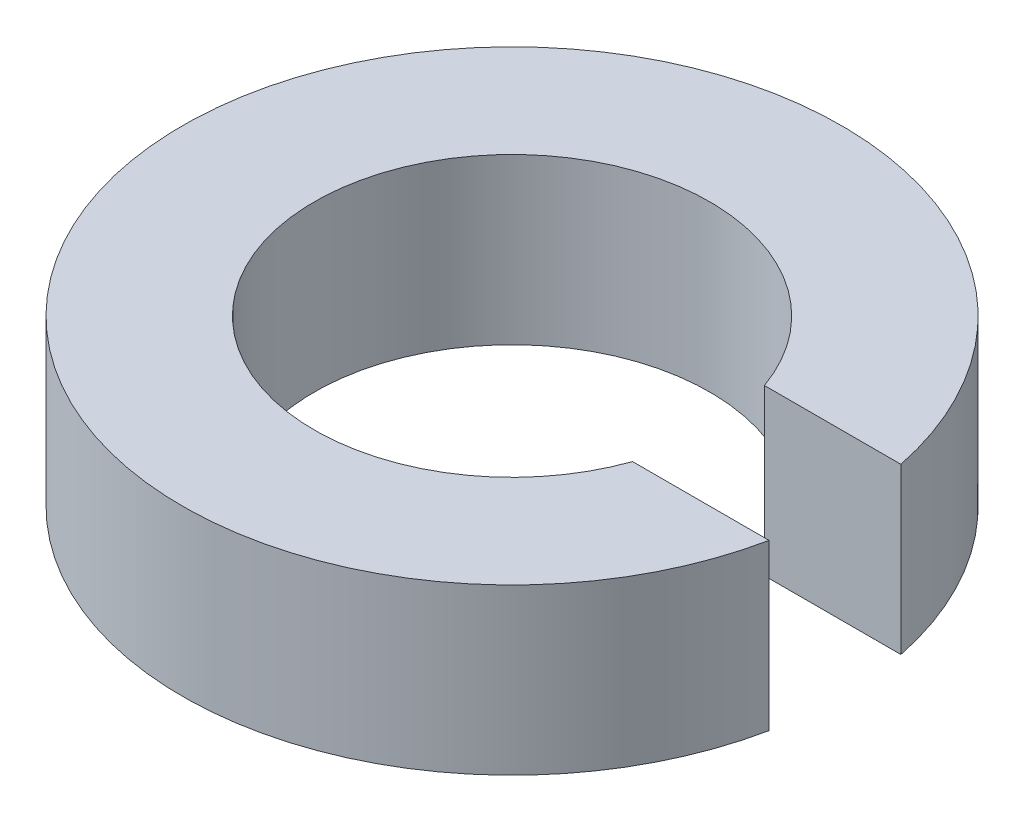
ISO-10303-21;
HEADER;
FILE_DESCRIPTION(('STEP AP214'),'2;1');
FILE_NAME('part.step','',(''),(''),'','','');
FILE_SCHEMA(('AUTOMOTIVE_DESIGN { 1 0 10303 214 1 1 1 1 }'));
ENDSEC;
DATA;
#1=APPLICATION_CONTEXT('core data for automotive mechanical design processes');
#2=APPLICATION_PROTOCOL_DEFINITION('international standard','automotive_design',2000,#1);
#3=PRODUCT_CONTEXT('',#1,'mechanical');
#4=PRODUCT('Part','Part','',(#3));
#5=PRODUCT_RELATED_PRODUCT_CATEGORY('part','',(#4));
#6=PRODUCT_DEFINITION_FORMATION('','',#4);
#7=PRODUCT_DEFINITION_CONTEXT('part definition',#1,'design');
#8=PRODUCT_DEFINITION('design','',#6,#7);
#9=PRODUCT_DEFINITION_SHAPE('','',#8);
#10=(LENGTH_UNIT() NAMED_UNIT(*) SI_UNIT(.MILLI.,.METRE.));
#11=(NAMED_UNIT(*) PLANE_ANGLE_UNIT() SI_UNIT($,.RADIAN.));
#12=(NAMED_UNIT(*) SI_UNIT($,.STERADIAN.) SOLID_ANGLE_UNIT());
#13=UNCERTAINTY_MEASURE_WITH_UNIT(LENGTH_MEASURE(1.E-05),#10,'distance_accuracy_value','');
#14=(GEOMETRIC_REPRESENTATION_CONTEXT(3) GLOBAL_UNCERTAINTY_ASSIGNED_CONTEXT((#13)) GLOBAL_UNIT_ASSIGNED_CONTEXT((#10,
#11,#12)) REPRESENTATION_CONTEXT('',''));
#15=CARTESIAN_POINT('',(0.,0.,0.));
#16=DIRECTION('',(0.,0.,1.));
#17=DIRECTION('',(1.,0.,0.));
#18=AXIS2_PLACEMENT_3D('',#15,#16,#17);
#19=CARTESIAN_POINT('',(120.,10.,-20.));
#20=DIRECTION('',(0.,-1.,0.));
#21=DIRECTION('',(0.,0.,-1.));
#22=AXIS2_PLACEMENT_3D('',#19,#20,#21);
#23=CYLINDRICAL_SURFACE('',#22,20.);
#24=CARTESIAN_POINT('',(120.,0.,-20.));
#25=DIRECTION('',(0.,1.,0.));
#26=DIRECTION('',(0.,0.,1.));
#27=AXIS2_PLACEMENT_3D('',#24,#25,#26);
#28=CIRCLE('',#27,20.);
#29=CARTESIAN_POINT('',(139.595917942265,0.,-24.));
#30=VERTEX_POINT('',#29);
#31=CARTESIAN_POINT('',(139.595917942265,0.,-16.));
#32=VERTEX_POINT('',#31);
#33=EDGE_CURVE('E96',#30,#32,#28,.T.);
#34=ORIENTED_EDGE('',*,*,#33,.T.);
#35=DIRECTION('',(0.,-1.,0.));
#36=VECTOR('',#35,1.);
#37=CARTESIAN_POINT('',(139.595917942265,10.,-16.));
#38=LINE('',#37,#36);
#39=CARTESIAN_POINT('',(139.595917942265,10.,-16.));
#40=VERTEX_POINT('',#39);
#41=EDGE_CURVE('E11',#40,#32,#38,.T.);
#42=ORIENTED_EDGE('',*,*,#41,.F.);
#43=CARTESIAN_POINT('',(120.,10.,-20.));
#44=DIRECTION('',(0.,1.,0.));
#45=DIRECTION('',(0.,0.,1.));
#46=AXIS2_PLACEMENT_3D('',#43,#44,#45);
#47=CIRCLE('',#46,20.);
#48=CARTESIAN_POINT('',(139.595917942265,10.,-24.));
#49=VERTEX_POINT('',#48);
#50=EDGE_CURVE('E84',#49,#40,#47,.T.);
#51=ORIENTED_EDGE('',*,*,#50,.F.);
#52=DIRECTION('',(0.,-1.,0.));
#53=VECTOR('',#52,1.);
#54=CARTESIAN_POINT('',(139.595917942265,10.,-24.));
#55=LINE('',#54,#53);
#56=EDGE_CURVE('E92',#49,#30,#55,.T.);
#57=ORIENTED_EDGE('',*,*,#56,.T.);
#58=EDGE_LOOP('',(#34,#42,#51,#57));
#59=FACE_BOUND('',#58,.T.);
#60=ADVANCED_FACE('F33',(#59),#23,.T.);
#61=CARTESIAN_POINT('',(131.313708498985,10.,-16.));
#62=DIRECTION('',(0.,0.,1.));
#63=DIRECTION('',(1.,0.,0.));
#64=AXIS2_PLACEMENT_3D('',#61,#62,#63);
#65=PLANE('',#64);
#66=DIRECTION('',(-1.,0.,0.));
#67=VECTOR('',#66,1.);
#68=CARTESIAN_POINT('',(131.313708498985,0.,-16.));
#69=LINE('',#68,#67);
#70=CARTESIAN_POINT('',(131.313708498985,0.,-16.));
#71=VERTEX_POINT('',#70);
#72=EDGE_CURVE('E88',#32,#71,#69,.T.);
#73=ORIENTED_EDGE('',*,*,#72,.T.);
#74=DIRECTION('',(0.,-1.,0.));
#75=VECTOR('',#74,1.);
#76=CARTESIAN_POINT('',(131.313708498985,10.,-16.));
#77=LINE('',#76,#75);
#78=CARTESIAN_POINT('',(131.313708498985,10.,-16.));
#79=VERTEX_POINT('',#78);
#80=EDGE_CURVE('E41',#79,#71,#77,.T.);
#81=ORIENTED_EDGE('',*,*,#80,.F.);
#82=DIRECTION('',(-1.,0.,0.));
#83=VECTOR('',#82,1.);
#84=CARTESIAN_POINT('',(131.313708498985,10.,-16.));
#85=LINE('',#84,#83);
#86=EDGE_CURVE('E79',#40,#79,#85,.T.);
#87=ORIENTED_EDGE('',*,*,#86,.F.);
#88=ORIENTED_EDGE('',*,*,#41,.T.);
#89=EDGE_LOOP('',(#73,#81,#87,#88));
#90=FACE_BOUND('',#89,.T.);
#91=ADVANCED_FACE('F87',(#90),#65,.F.);
#92=CARTESIAN_POINT('',(120.,10.,-20.));
#93=DIRECTION('',(0.,-1.,0.));
#94=DIRECTION('',(0.,0.,-1.));
#95=AXIS2_PLACEMENT_3D('',#92,#93,#94);
#96=CYLINDRICAL_SURFACE('',#95,12.);
#97=CARTESIAN_POINT('',(120.,0.,-20.));
#98=DIRECTION('',(0.,-1.,0.));
#99=DIRECTION('',(0.,0.,1.));
#100=AXIS2_PLACEMENT_3D('',#97,#98,#99);
#101=CIRCLE('',#100,12.);
#102=CARTESIAN_POINT('',(131.313708498985,0.,-24.));
#103=VERTEX_POINT('',#102);
#104=EDGE_CURVE('E66',#71,#103,#101,.T.);
#105=ORIENTED_EDGE('',*,*,#104,.T.);
#106=DIRECTION('',(0.,-1.,0.));
#107=VECTOR('',#106,1.);
#108=CARTESIAN_POINT('',(131.313708498985,10.,-24.));
#109=LINE('',#108,#107);
#110=CARTESIAN_POINT('',(131.313708498985,10.,-24.));
#111=VERTEX_POINT('',#110);
#112=EDGE_CURVE('E89',#111,#103,#109,.T.);
#113=ORIENTED_EDGE('',*,*,#112,.F.);
#114=CARTESIAN_POINT('',(120.,10.,-20.));
#115=DIRECTION('',(0.,-1.,0.));
#116=DIRECTION('',(0.,0.,1.));
#117=AXIS2_PLACEMENT_3D('',#114,#115,#116);
#118=CIRCLE('',#117,12.);
#119=EDGE_CURVE('E82',#79,#111,#118,.T.);
#120=ORIENTED_EDGE('',*,*,#119,.F.);
#121=ORIENTED_EDGE('',*,*,#80,.T.);
#122=EDGE_LOOP('',(#105,#113,#120,#121));
#123=FACE_BOUND('',#122,.T.);
#124=ADVANCED_FACE('F90',(#123),#96,.F.);
#125=CARTESIAN_POINT('',(131.313708498985,10.,-24.));
#126=DIRECTION('',(0.,0.,-1.));
#127=DIRECTION('',(-1.,0.,0.));
#128=AXIS2_PLACEMENT_3D('',#125,#126,#127);
#129=PLANE('',#128);
#130=DIRECTION('',(1.,0.,0.));
#131=VECTOR('',#130,1.);
#132=CARTESIAN_POINT('',(131.313708498985,0.,-24.));
#133=LINE('',#132,#131);
#134=EDGE_CURVE('E72',#103,#30,#133,.T.);
#135=ORIENTED_EDGE('',*,*,#134,.T.);
#136=ORIENTED_EDGE('',*,*,#56,.F.);
#137=DIRECTION('',(1.,0.,0.));
#138=VECTOR('',#137,1.);
#139=CARTESIAN_POINT('',(131.313708498985,10.,-24.));
#140=LINE('',#139,#138);
#141=EDGE_CURVE('E49',#111,#49,#140,.T.);
#142=ORIENTED_EDGE('',*,*,#141,.F.);
#143=ORIENTED_EDGE('',*,*,#112,.T.);
#144=EDGE_LOOP('',(#135,#136,#142,#143));
#145=FACE_BOUND('',#144,.T.);
#146=ADVANCED_FACE('F103',(#145),#129,.F.);
#147=CARTESIAN_POINT('',(120.,10.,-20.));
#148=DIRECTION('',(0.,1.,0.));
#149=DIRECTION('',(0.,0.,1.));
#150=AXIS2_PLACEMENT_3D('',#147,#148,#149);
#151=PLANE('',#150);
#152=ORIENTED_EDGE('',*,*,#50,.T.);
#153=ORIENTED_EDGE('',*,*,#86,.T.);
#154=ORIENTED_EDGE('',*,*,#119,.T.);
#155=ORIENTED_EDGE('',*,*,#141,.T.);
#156=EDGE_LOOP('',(#152,#153,#154,#155));
#157=FACE_BOUND('',#156,.T.);
#158=ADVANCED_FACE('F80',(#157),#151,.T.);
#159=CARTESIAN_POINT('',(120.,0.,-20.));
#160=DIRECTION('',(0.,1.,0.));
#161=DIRECTION('',(0.,0.,1.));
#162=AXIS2_PLACEMENT_3D('',#159,#160,#161);
#163=PLANE('',#162);
#164=ORIENTED_EDGE('',*,*,#33,.F.);
#165=ORIENTED_EDGE('',*,*,#134,.F.);
#166=ORIENTED_EDGE('',*,*,#104,.F.);
#167=ORIENTED_EDGE('',*,*,#72,.F.);
#168=EDGE_LOOP('',(#164,#165,#166,#167));
#169=FACE_BOUND('',#168,.T.);
#170=ADVANCED_FACE('F106',(#169),#163,.F.);
#171=CLOSED_SHELL('',(#60,#91,#124,#146,#158,#170));
#172=MANIFOLD_SOLID_BREP('B2',#171);
#173=ADVANCED_BREP_SHAPE_REPRESENTATION('',(#18,#172),#14);
#174=SHAPE_DEFINITION_REPRESENTATION(#9,#173);
ENDSEC;
END-ISO-10303-21;
